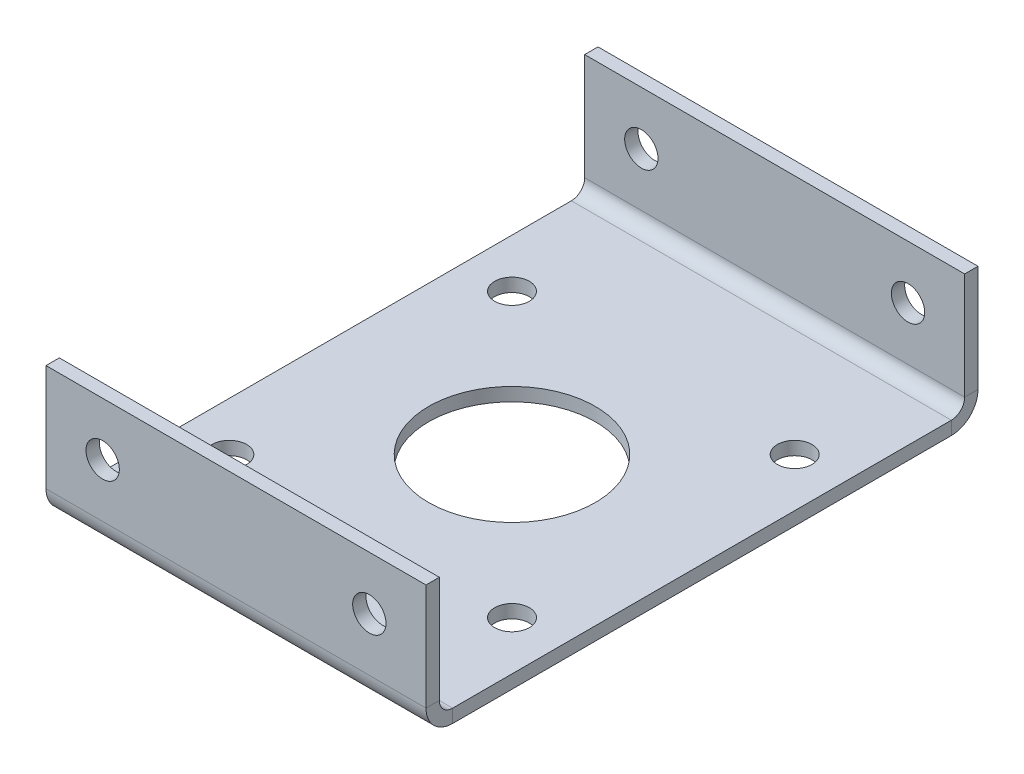
ISO-10303-21;
HEADER;
FILE_DESCRIPTION(('STEP AP214'),'2;1');
FILE_NAME('part.step','',(''),(''),'','','');
FILE_SCHEMA(('AUTOMOTIVE_DESIGN { 1 0 10303 214 1 1 1 1 }'));
ENDSEC;
DATA;
#1=APPLICATION_CONTEXT('core data for automotive mechanical design processes');
#2=APPLICATION_PROTOCOL_DEFINITION('international standard','automotive_design',2000,#1);
#3=PRODUCT_CONTEXT('',#1,'mechanical');
#4=PRODUCT('Part','Part','',(#3));
#5=PRODUCT_RELATED_PRODUCT_CATEGORY('part','',(#4));
#6=PRODUCT_DEFINITION_FORMATION('','',#4);
#7=PRODUCT_DEFINITION_CONTEXT('part definition',#1,'design');
#8=PRODUCT_DEFINITION('design','',#6,#7);
#9=PRODUCT_DEFINITION_SHAPE('','',#8);
#10=(LENGTH_UNIT() NAMED_UNIT(*) SI_UNIT(.MILLI.,.METRE.));
#11=(NAMED_UNIT(*) PLANE_ANGLE_UNIT() SI_UNIT($,.RADIAN.));
#12=(NAMED_UNIT(*) SI_UNIT($,.STERADIAN.) SOLID_ANGLE_UNIT());
#13=UNCERTAINTY_MEASURE_WITH_UNIT(LENGTH_MEASURE(1.E-05),#10,'distance_accuracy_value','');
#14=(GEOMETRIC_REPRESENTATION_CONTEXT(3) GLOBAL_UNCERTAINTY_ASSIGNED_CONTEXT((#13)) GLOBAL_UNIT_ASSIGNED_CONTEXT((#10,
#11,#12)) REPRESENTATION_CONTEXT('',''));
#15=CARTESIAN_POINT('',(0.,0.,0.));
#16=DIRECTION('',(0.,0.,1.));
#17=DIRECTION('',(1.,0.,0.));
#18=AXIS2_PLACEMENT_3D('',#15,#16,#17);
#19=CARTESIAN_POINT('',(0.,-1.27,0.));
#20=DIRECTION('',(0.,1.,0.));
#21=DIRECTION('',(0.,0.,1.));
#22=AXIS2_PLACEMENT_3D('',#19,#20,#21);
#23=PLANE('',#22);
#24=CARTESIAN_POINT('',(-13.462,-1.27000000000001,-13.4619999999999));
#25=DIRECTION('',(0.,1.,0.));
#26=DIRECTION('',(1.,0.,0.));
#27=AXIS2_PLACEMENT_3D('',#24,#25,#26);
#28=CIRCLE('',#27,1.651);
#29=CARTESIAN_POINT('',(-11.811,-1.27000000000001,-13.4619999999999));
#30=VERTEX_POINT('',#29);
#31=EDGE_CURVE('E273',#30,#30,#28,.T.);
#32=ORIENTED_EDGE('',*,*,#31,.T.);
#33=EDGE_LOOP('',(#32));
#34=FACE_BOUND('',#33,.T.);
#35=CARTESIAN_POINT('',(-13.462,-1.27000000000001,13.462));
#36=DIRECTION('',(0.,1.,0.));
#37=DIRECTION('',(0.,0.,-1.));
#38=AXIS2_PLACEMENT_3D('',#35,#36,#37);
#39=CIRCLE('',#38,1.651);
#40=CARTESIAN_POINT('',(-13.462,-1.27000000000001,11.811));
#41=VERTEX_POINT('',#40);
#42=EDGE_CURVE('E445',#41,#41,#39,.T.);
#43=ORIENTED_EDGE('',*,*,#42,.T.);
#44=EDGE_LOOP('',(#43));
#45=FACE_BOUND('',#44,.T.);
#46=CARTESIAN_POINT('',(13.4620000000001,-1.27000000000001,13.4619999999998));
#47=DIRECTION('',(0.,1.,0.));
#48=DIRECTION('',(-1.,0.,0.));
#49=AXIS2_PLACEMENT_3D('',#46,#47,#48);
#50=CIRCLE('',#49,1.651);
#51=CARTESIAN_POINT('',(11.8110000000001,-1.27000000000001,13.4619999999998));
#52=VERTEX_POINT('',#51);
#53=EDGE_CURVE('E453',#52,#52,#50,.T.);
#54=ORIENTED_EDGE('',*,*,#53,.T.);
#55=EDGE_LOOP('',(#54));
#56=FACE_BOUND('',#55,.T.);
#57=CARTESIAN_POINT('',(13.462,-1.27000000000001,-13.462));
#58=DIRECTION('',(0.,1.,0.));
#59=DIRECTION('',(0.,0.,1.));
#60=AXIS2_PLACEMENT_3D('',#57,#58,#59);
#61=CIRCLE('',#60,1.651);
#62=CARTESIAN_POINT('',(13.462,-1.27000000000001,-11.811));
#63=VERTEX_POINT('',#62);
#64=EDGE_CURVE('E288',#63,#63,#61,.T.);
#65=ORIENTED_EDGE('',*,*,#64,.T.);
#66=EDGE_LOOP('',(#65));
#67=FACE_BOUND('',#66,.T.);
#68=CARTESIAN_POINT('',(0.,-1.27,0.));
#69=DIRECTION('',(0.,1.,0.));
#70=DIRECTION('',(0.,0.,1.));
#71=AXIS2_PLACEMENT_3D('',#68,#69,#70);
#72=CIRCLE('',#71,7.9375);
#73=CARTESIAN_POINT('',(0.,-1.27,7.9375));
#74=VERTEX_POINT('',#73);
#75=EDGE_CURVE('E248',#74,#74,#72,.T.);
#76=ORIENTED_EDGE('',*,*,#75,.T.);
#77=EDGE_LOOP('',(#76));
#78=FACE_BOUND('',#77,.T.);
#79=DIRECTION('',(-1.,0.,0.));
#80=VECTOR('',#79,1.);
#81=CARTESIAN_POINT('',(-18.0975,-1.27000000000001,-23.749));
#82=LINE('',#81,#80);
#83=CARTESIAN_POINT('',(-18.0975,-1.27000000000001,-23.749));
#84=VERTEX_POINT('',#83);
#85=CARTESIAN_POINT('',(18.0975,-1.27,-23.749));
#86=VERTEX_POINT('',#85);
#87=EDGE_CURVE('E137',#84,#86,#82,.F.);
#88=ORIENTED_EDGE('',*,*,#87,.T.);
#89=DIRECTION('',(0.,0.,-1.));
#90=VECTOR('',#89,1.);
#91=CARTESIAN_POINT('',(18.0975,-1.27,-25.019));
#92=LINE('',#91,#90);
#93=CARTESIAN_POINT('',(18.0975,-1.27,23.749));
#94=VERTEX_POINT('',#93);
#95=EDGE_CURVE('E48',#94,#86,#92,.T.);
#96=ORIENTED_EDGE('',*,*,#95,.F.);
#97=DIRECTION('',(1.,0.,0.));
#98=VECTOR('',#97,1.);
#99=CARTESIAN_POINT('',(18.0975,-1.27,23.749));
#100=LINE('',#99,#98);
#101=CARTESIAN_POINT('',(-18.0975,-1.27,23.749));
#102=VERTEX_POINT('',#101);
#103=EDGE_CURVE('E227',#94,#102,#100,.F.);
#104=ORIENTED_EDGE('',*,*,#103,.T.);
#105=DIRECTION('',(0.,0.,1.));
#106=VECTOR('',#105,1.);
#107=CARTESIAN_POINT('',(-18.0975,-1.27,-25.019));
#108=LINE('',#107,#106);
#109=EDGE_CURVE('E11',#84,#102,#108,.T.);
#110=ORIENTED_EDGE('',*,*,#109,.F.);
#111=EDGE_LOOP('',(#88,#96,#104,#110));
#112=FACE_BOUND('',#111,.T.);
#113=ADVANCED_FACE('F39',(#34,#45,#56,#67,#78,#112),#23,.F.);
#114=CARTESIAN_POINT('',(0.,0.,0.));
#115=DIRECTION('',(0.,1.,0.));
#116=DIRECTION('',(0.,0.,1.));
#117=AXIS2_PLACEMENT_3D('',#114,#115,#116);
#118=PLANE('',#117);
#119=CARTESIAN_POINT('',(-13.462,0.,-13.4619999999999));
#120=DIRECTION('',(0.,1.,0.));
#121=DIRECTION('',(1.,0.,0.));
#122=AXIS2_PLACEMENT_3D('',#119,#120,#121);
#123=CIRCLE('',#122,1.651);
#124=CARTESIAN_POINT('',(-11.811,0.,-13.4619999999999));
#125=VERTEX_POINT('',#124);
#126=EDGE_CURVE('E444',#125,#125,#123,.T.);
#127=ORIENTED_EDGE('',*,*,#126,.F.);
#128=EDGE_LOOP('',(#127));
#129=FACE_BOUND('',#128,.T.);
#130=CARTESIAN_POINT('',(-13.462,0.,13.462));
#131=DIRECTION('',(0.,1.,0.));
#132=DIRECTION('',(0.,0.,-1.));
#133=AXIS2_PLACEMENT_3D('',#130,#131,#132);
#134=CIRCLE('',#133,1.651);
#135=CARTESIAN_POINT('',(-13.462,0.,11.811));
#136=VERTEX_POINT('',#135);
#137=EDGE_CURVE('E449',#136,#136,#134,.T.);
#138=ORIENTED_EDGE('',*,*,#137,.F.);
#139=EDGE_LOOP('',(#138));
#140=FACE_BOUND('',#139,.T.);
#141=CARTESIAN_POINT('',(13.4620000000001,0.,13.4619999999998));
#142=DIRECTION('',(0.,1.,0.));
#143=DIRECTION('',(-1.,0.,0.));
#144=AXIS2_PLACEMENT_3D('',#141,#142,#143);
#145=CIRCLE('',#144,1.651);
#146=CARTESIAN_POINT('',(11.8110000000001,0.,13.4619999999998));
#147=VERTEX_POINT('',#146);
#148=EDGE_CURVE('E276',#147,#147,#145,.T.);
#149=ORIENTED_EDGE('',*,*,#148,.F.);
#150=EDGE_LOOP('',(#149));
#151=FACE_BOUND('',#150,.T.);
#152=CARTESIAN_POINT('',(13.462,0.,-13.462));
#153=DIRECTION('',(0.,1.,0.));
#154=DIRECTION('',(0.,0.,1.));
#155=AXIS2_PLACEMENT_3D('',#152,#153,#154);
#156=CIRCLE('',#155,1.651);
#157=CARTESIAN_POINT('',(13.462,0.,-11.811));
#158=VERTEX_POINT('',#157);
#159=EDGE_CURVE('E287',#158,#158,#156,.T.);
#160=ORIENTED_EDGE('',*,*,#159,.F.);
#161=EDGE_LOOP('',(#160));
#162=FACE_BOUND('',#161,.T.);
#163=CARTESIAN_POINT('',(0.,0.,0.));
#164=DIRECTION('',(0.,1.,0.));
#165=DIRECTION('',(0.,0.,1.));
#166=AXIS2_PLACEMENT_3D('',#163,#164,#165);
#167=CIRCLE('',#166,7.9375);
#168=CARTESIAN_POINT('',(0.,0.,7.9375));
#169=VERTEX_POINT('',#168);
#170=EDGE_CURVE('E245',#169,#169,#167,.T.);
#171=ORIENTED_EDGE('',*,*,#170,.F.);
#172=EDGE_LOOP('',(#171));
#173=FACE_BOUND('',#172,.T.);
#174=DIRECTION('',(0.,0.,-1.));
#175=VECTOR('',#174,1.);
#176=CARTESIAN_POINT('',(18.0975,0.,-25.019));
#177=LINE('',#176,#175);
#178=CARTESIAN_POINT('',(18.0975,0.,23.749));
#179=VERTEX_POINT('',#178);
#180=CARTESIAN_POINT('',(18.0975,0.,-23.749));
#181=VERTEX_POINT('',#180);
#182=EDGE_CURVE('E251',#179,#181,#177,.T.);
#183=ORIENTED_EDGE('',*,*,#182,.T.);
#184=DIRECTION('',(-1.,0.,0.));
#185=VECTOR('',#184,1.);
#186=CARTESIAN_POINT('',(-18.0975,0.,-23.749));
#187=LINE('',#186,#185);
#188=CARTESIAN_POINT('',(-18.0975,0.,-23.749));
#189=VERTEX_POINT('',#188);
#190=EDGE_CURVE('E188',#189,#181,#187,.F.);
#191=ORIENTED_EDGE('',*,*,#190,.F.);
#192=DIRECTION('',(0.,0.,1.));
#193=VECTOR('',#192,1.);
#194=CARTESIAN_POINT('',(-18.0975,0.,-25.019));
#195=LINE('',#194,#193);
#196=CARTESIAN_POINT('',(-18.0975,0.,23.749));
#197=VERTEX_POINT('',#196);
#198=EDGE_CURVE('E255',#189,#197,#195,.T.);
#199=ORIENTED_EDGE('',*,*,#198,.T.);
#200=DIRECTION('',(1.,0.,0.));
#201=VECTOR('',#200,1.);
#202=CARTESIAN_POINT('',(18.0975,0.,23.749));
#203=LINE('',#202,#201);
#204=EDGE_CURVE('E56',#179,#197,#203,.F.);
#205=ORIENTED_EDGE('',*,*,#204,.F.);
#206=EDGE_LOOP('',(#183,#191,#199,#205));
#207=FACE_BOUND('',#206,.T.);
#208=ADVANCED_FACE('F325',(#129,#140,#151,#162,#173,#207),#118,.T.);
#209=CARTESIAN_POINT('',(-18.0975,-1.27,-25.019));
#210=DIRECTION('',(-1.,0.,0.));
#211=DIRECTION('',(0.,0.,1.));
#212=AXIS2_PLACEMENT_3D('',#209,#210,#211);
#213=PLANE('',#212);
#214=ORIENTED_EDGE('',*,*,#198,.F.);
#215=DIRECTION('',(0.,-1.,0.));
#216=VECTOR('',#215,1.);
#217=CARTESIAN_POINT('',(-18.0975,0.,-23.749));
#218=LINE('',#217,#216);
#219=EDGE_CURVE('E184',#189,#84,#218,.T.);
#220=ORIENTED_EDGE('',*,*,#219,.T.);
#221=ORIENTED_EDGE('',*,*,#109,.T.);
#222=DIRECTION('',(0.,-1.,0.));
#223=VECTOR('',#222,1.);
#224=CARTESIAN_POINT('',(-18.0975,0.,23.749));
#225=LINE('',#224,#223);
#226=EDGE_CURVE('E242',#197,#102,#225,.T.);
#227=ORIENTED_EDGE('',*,*,#226,.F.);
#228=EDGE_LOOP('',(#214,#220,#221,#227));
#229=FACE_BOUND('',#228,.T.);
#230=ADVANCED_FACE('F331',(#229),#213,.T.);
#231=CARTESIAN_POINT('',(18.0975,-1.27,-25.019));
#232=DIRECTION('',(1.,0.,0.));
#233=DIRECTION('',(0.,0.,-1.));
#234=AXIS2_PLACEMENT_3D('',#231,#232,#233);
#235=PLANE('',#234);
#236=DIRECTION('',(0.,-1.,0.));
#237=VECTOR('',#236,1.);
#238=CARTESIAN_POINT('',(18.0975,0.,-23.749));
#239=LINE('',#238,#237);
#240=EDGE_CURVE('E192',#181,#86,#239,.T.);
#241=ORIENTED_EDGE('',*,*,#240,.F.);
#242=ORIENTED_EDGE('',*,*,#182,.F.);
#243=DIRECTION('',(0.,-1.,0.));
#244=VECTOR('',#243,1.);
#245=CARTESIAN_POINT('',(18.0975,0.,23.749));
#246=LINE('',#245,#244);
#247=EDGE_CURVE('E233',#179,#94,#246,.T.);
#248=ORIENTED_EDGE('',*,*,#247,.T.);
#249=ORIENTED_EDGE('',*,*,#95,.T.);
#250=EDGE_LOOP('',(#241,#242,#248,#249));
#251=FACE_BOUND('',#250,.T.);
#252=ADVANCED_FACE('F41',(#251),#235,.T.);
#253=CARTESIAN_POINT('',(0.,-1.27,0.));
#254=DIRECTION('',(0.,1.,0.));
#255=DIRECTION('',(0.,0.,1.));
#256=AXIS2_PLACEMENT_3D('',#253,#254,#255);
#257=CYLINDRICAL_SURFACE('',#256,7.9375);
#258=ORIENTED_EDGE('',*,*,#75,.F.);
#259=EDGE_LOOP('',(#258));
#260=FACE_BOUND('',#259,.T.);
#261=ORIENTED_EDGE('',*,*,#170,.T.);
#262=EDGE_LOOP('',(#261));
#263=FACE_BOUND('',#262,.T.);
#264=ADVANCED_FACE('F337',(#260,#263),#257,.F.);
#265=CARTESIAN_POINT('',(-18.0975,1.27,23.749));
#266=DIRECTION('',(-1.,0.,0.));
#267=DIRECTION('',(0.,0.,1.));
#268=AXIS2_PLACEMENT_3D('',#265,#266,#267);
#269=PLANE('',#268);
#270=DIRECTION('',(0.,0.,1.));
#271=VECTOR('',#270,1.);
#272=CARTESIAN_POINT('',(-18.0975,1.27,25.019));
#273=LINE('',#272,#271);
#274=CARTESIAN_POINT('',(-18.0975,1.27,25.019));
#275=VERTEX_POINT('',#274);
#276=CARTESIAN_POINT('',(-18.0975,1.27,26.289));
#277=VERTEX_POINT('',#276);
#278=EDGE_CURVE('E195',#275,#277,#273,.T.);
#279=ORIENTED_EDGE('',*,*,#278,.F.);
#280=CARTESIAN_POINT('',(-18.0975,1.27,23.749));
#281=DIRECTION('',(1.,0.,0.));
#282=DIRECTION('',(0.,0.,-1.));
#283=AXIS2_PLACEMENT_3D('',#280,#281,#282);
#284=CIRCLE('',#283,1.27);
#285=EDGE_CURVE('E236',#197,#275,#284,.F.);
#286=ORIENTED_EDGE('',*,*,#285,.F.);
#287=ORIENTED_EDGE('',*,*,#226,.T.);
#288=CARTESIAN_POINT('',(-18.0975,1.27,23.749));
#289=DIRECTION('',(1.,0.,0.));
#290=DIRECTION('',(0.,0.,-1.));
#291=AXIS2_PLACEMENT_3D('',#288,#289,#290);
#292=CIRCLE('',#291,2.54);
#293=EDGE_CURVE('E229',#102,#277,#292,.F.);
#294=ORIENTED_EDGE('',*,*,#293,.T.);
#295=EDGE_LOOP('',(#279,#286,#287,#294));
#296=FACE_BOUND('',#295,.T.);
#297=ADVANCED_FACE('F378',(#296),#269,.T.);
#298=CARTESIAN_POINT('',(18.0975,1.27,23.749));
#299=DIRECTION('',(-1.,0.,0.));
#300=DIRECTION('',(0.,0.,1.));
#301=AXIS2_PLACEMENT_3D('',#298,#299,#300);
#302=PLANE('',#301);
#303=CARTESIAN_POINT('',(18.0975,1.27,23.749));
#304=DIRECTION('',(1.,0.,0.));
#305=DIRECTION('',(0.,0.,-1.));
#306=AXIS2_PLACEMENT_3D('',#303,#304,#305);
#307=CIRCLE('',#306,1.27);
#308=CARTESIAN_POINT('',(18.0975,1.27,25.019));
#309=VERTEX_POINT('',#308);
#310=EDGE_CURVE('E226',#309,#179,#307,.T.);
#311=ORIENTED_EDGE('',*,*,#310,.F.);
#312=DIRECTION('',(0.,0.,1.));
#313=VECTOR('',#312,1.);
#314=CARTESIAN_POINT('',(18.0975,1.27,25.019));
#315=LINE('',#314,#313);
#316=CARTESIAN_POINT('',(18.0975,1.27,26.289));
#317=VERTEX_POINT('',#316);
#318=EDGE_CURVE('E199',#309,#317,#315,.T.);
#319=ORIENTED_EDGE('',*,*,#318,.T.);
#320=CARTESIAN_POINT('',(18.0975,1.27,23.749));
#321=DIRECTION('',(1.,0.,0.));
#322=DIRECTION('',(0.,0.,-1.));
#323=AXIS2_PLACEMENT_3D('',#320,#321,#322);
#324=CIRCLE('',#323,2.54);
#325=EDGE_CURVE('E230',#317,#94,#324,.T.);
#326=ORIENTED_EDGE('',*,*,#325,.T.);
#327=ORIENTED_EDGE('',*,*,#247,.F.);
#328=EDGE_LOOP('',(#311,#319,#326,#327));
#329=FACE_BOUND('',#328,.T.);
#330=ADVANCED_FACE('F349',(#329),#302,.F.);
#331=CARTESIAN_POINT('',(18.0975,1.27,23.749));
#332=DIRECTION('',(1.,0.,0.));
#333=DIRECTION('',(0.,0.,1.));
#334=AXIS2_PLACEMENT_3D('',#331,#332,#333);
#335=CYLINDRICAL_SURFACE('',#334,2.54);
#336=ORIENTED_EDGE('',*,*,#103,.F.);
#337=ORIENTED_EDGE('',*,*,#325,.F.);
#338=DIRECTION('',(-1.,0.,0.));
#339=VECTOR('',#338,1.);
#340=CARTESIAN_POINT('',(0.,1.27,26.289));
#341=LINE('',#340,#339);
#342=EDGE_CURVE('E202',#317,#277,#341,.T.);
#343=ORIENTED_EDGE('',*,*,#342,.T.);
#344=ORIENTED_EDGE('',*,*,#293,.F.);
#345=EDGE_LOOP('',(#336,#337,#343,#344));
#346=FACE_BOUND('',#345,.T.);
#347=ADVANCED_FACE('F376',(#346),#335,.T.);
#348=CARTESIAN_POINT('',(18.0975,1.27,23.749));
#349=DIRECTION('',(1.,0.,0.));
#350=DIRECTION('',(0.,0.,1.));
#351=AXIS2_PLACEMENT_3D('',#348,#349,#350);
#352=CYLINDRICAL_SURFACE('',#351,1.27);
#353=ORIENTED_EDGE('',*,*,#204,.T.);
#354=ORIENTED_EDGE('',*,*,#285,.T.);
#355=DIRECTION('',(1.,0.,0.));
#356=VECTOR('',#355,1.);
#357=CARTESIAN_POINT('',(-18.0975,1.27,25.019));
#358=LINE('',#357,#356);
#359=EDGE_CURVE('E197',#275,#309,#358,.T.);
#360=ORIENTED_EDGE('',*,*,#359,.T.);
#361=ORIENTED_EDGE('',*,*,#310,.T.);
#362=EDGE_LOOP('',(#353,#354,#360,#361));
#363=FACE_BOUND('',#362,.T.);
#364=ADVANCED_FACE('F352',(#363),#352,.F.);
#365=CARTESIAN_POINT('',(-18.0975,0.,26.289));
#366=DIRECTION('',(1.,0.,0.));
#367=DIRECTION('',(0.,1.,0.));
#368=AXIS2_PLACEMENT_3D('',#365,#366,#367);
#369=PLANE('',#368);
#370=ORIENTED_EDGE('',*,*,#278,.T.);
#371=DIRECTION('',(0.,-1.,0.));
#372=VECTOR('',#371,1.);
#373=CARTESIAN_POINT('',(-18.0975,0.,26.289));
#374=LINE('',#373,#372);
#375=CARTESIAN_POINT('',(-18.0975,11.43,26.289));
#376=VERTEX_POINT('',#375);
#377=EDGE_CURVE('E207',#376,#277,#374,.T.);
#378=ORIENTED_EDGE('',*,*,#377,.F.);
#379=DIRECTION('',(0.,0.,-1.));
#380=VECTOR('',#379,1.);
#381=CARTESIAN_POINT('',(-18.0975,11.43,26.289));
#382=LINE('',#381,#380);
#383=CARTESIAN_POINT('',(-18.0975,11.43,25.019));
#384=VERTEX_POINT('',#383);
#385=EDGE_CURVE('E215',#376,#384,#382,.T.);
#386=ORIENTED_EDGE('',*,*,#385,.T.);
#387=DIRECTION('',(0.,-1.,0.));
#388=VECTOR('',#387,1.);
#389=CARTESIAN_POINT('',(-18.0975,0.,25.019));
#390=LINE('',#389,#388);
#391=EDGE_CURVE('E206',#384,#275,#390,.T.);
#392=ORIENTED_EDGE('',*,*,#391,.T.);
#393=EDGE_LOOP('',(#370,#378,#386,#392));
#394=FACE_BOUND('',#393,.T.);
#395=ADVANCED_FACE('F361',(#394),#369,.F.);
#396=CARTESIAN_POINT('',(18.0975,11.43,26.289));
#397=DIRECTION('',(-1.,0.,0.));
#398=DIRECTION('',(0.,-1.,0.));
#399=AXIS2_PLACEMENT_3D('',#396,#397,#398);
#400=PLANE('',#399);
#401=ORIENTED_EDGE('',*,*,#318,.F.);
#402=DIRECTION('',(0.,1.,0.));
#403=VECTOR('',#402,1.);
#404=CARTESIAN_POINT('',(18.0975,11.43,25.019));
#405=LINE('',#404,#403);
#406=CARTESIAN_POINT('',(18.0975,11.43,25.019));
#407=VERTEX_POINT('',#406);
#408=EDGE_CURVE('E218',#309,#407,#405,.T.);
#409=ORIENTED_EDGE('',*,*,#408,.T.);
#410=DIRECTION('',(0.,0.,-1.));
#411=VECTOR('',#410,1.);
#412=CARTESIAN_POINT('',(18.0975,11.43,26.289));
#413=LINE('',#412,#411);
#414=CARTESIAN_POINT('',(18.0975,11.43,26.289));
#415=VERTEX_POINT('',#414);
#416=EDGE_CURVE('E223',#415,#407,#413,.T.);
#417=ORIENTED_EDGE('',*,*,#416,.F.);
#418=DIRECTION('',(0.,1.,0.));
#419=VECTOR('',#418,1.);
#420=CARTESIAN_POINT('',(18.0975,11.43,26.289));
#421=LINE('',#420,#419);
#422=EDGE_CURVE('E210',#317,#415,#421,.T.);
#423=ORIENTED_EDGE('',*,*,#422,.F.);
#424=EDGE_LOOP('',(#401,#409,#417,#423));
#425=FACE_BOUND('',#424,.T.);
#426=ADVANCED_FACE('F370',(#425),#400,.F.);
#427=CARTESIAN_POINT('',(0.,0.,26.289));
#428=DIRECTION('',(0.,0.,-1.));
#429=DIRECTION('',(-1.,0.,0.));
#430=AXIS2_PLACEMENT_3D('',#427,#428,#429);
#431=PLANE('',#430);
#432=CARTESIAN_POINT('',(12.7,6.35000000000001,26.289));
#433=DIRECTION('',(0.,0.,-1.));
#434=DIRECTION('',(-1.,0.,0.));
#435=AXIS2_PLACEMENT_3D('',#432,#433,#434);
#436=CIRCLE('',#435,1.5875);
#437=CARTESIAN_POINT('',(11.1125,6.35000000000001,26.289));
#438=VERTEX_POINT('',#437);
#439=EDGE_CURVE('E261',#438,#438,#436,.T.);
#440=ORIENTED_EDGE('',*,*,#439,.T.);
#441=EDGE_LOOP('',(#440));
#442=FACE_BOUND('',#441,.T.);
#443=CARTESIAN_POINT('',(-12.7,6.35000000000001,26.289));
#444=DIRECTION('',(0.,0.,-1.));
#445=DIRECTION('',(1.,0.,0.));
#446=AXIS2_PLACEMENT_3D('',#443,#444,#445);
#447=CIRCLE('',#446,1.5875);
#448=CARTESIAN_POINT('',(-11.1125,6.35000000000001,26.289));
#449=VERTEX_POINT('',#448);
#450=EDGE_CURVE('E268',#449,#449,#447,.T.);
#451=ORIENTED_EDGE('',*,*,#450,.T.);
#452=EDGE_LOOP('',(#451));
#453=FACE_BOUND('',#452,.T.);
#454=ORIENTED_EDGE('',*,*,#342,.F.);
#455=ORIENTED_EDGE('',*,*,#422,.T.);
#456=DIRECTION('',(-1.,0.,0.));
#457=VECTOR('',#456,1.);
#458=CARTESIAN_POINT('',(-18.0975,11.43,26.289));
#459=LINE('',#458,#457);
#460=EDGE_CURVE('E213',#415,#376,#459,.T.);
#461=ORIENTED_EDGE('',*,*,#460,.T.);
#462=ORIENTED_EDGE('',*,*,#377,.T.);
#463=EDGE_LOOP('',(#454,#455,#461,#462));
#464=FACE_BOUND('',#463,.T.);
#465=ADVANCED_FACE('F373',(#442,#453,#464),#431,.F.);
#466=CARTESIAN_POINT('',(0.,0.,25.019));
#467=DIRECTION('',(0.,0.,-1.));
#468=DIRECTION('',(-1.,0.,0.));
#469=AXIS2_PLACEMENT_3D('',#466,#467,#468);
#470=PLANE('',#469);
#471=CARTESIAN_POINT('',(12.7,6.35000000000001,25.019));
#472=DIRECTION('',(0.,0.,-1.));
#473=DIRECTION('',(-1.,0.,0.));
#474=AXIS2_PLACEMENT_3D('',#471,#472,#473);
#475=CIRCLE('',#474,1.5875);
#476=CARTESIAN_POINT('',(11.1125,6.35000000000001,25.019));
#477=VERTEX_POINT('',#476);
#478=EDGE_CURVE('E284',#477,#477,#475,.T.);
#479=ORIENTED_EDGE('',*,*,#478,.F.);
#480=EDGE_LOOP('',(#479));
#481=FACE_BOUND('',#480,.T.);
#482=CARTESIAN_POINT('',(-12.7,6.35000000000001,25.019));
#483=DIRECTION('',(0.,0.,-1.));
#484=DIRECTION('',(-1.,0.,0.));
#485=AXIS2_PLACEMENT_3D('',#482,#483,#484);
#486=CIRCLE('',#485,1.5875);
#487=CARTESIAN_POINT('',(-14.2875,6.35000000000001,25.019));
#488=VERTEX_POINT('',#487);
#489=EDGE_CURVE('E265',#488,#488,#486,.T.);
#490=ORIENTED_EDGE('',*,*,#489,.F.);
#491=EDGE_LOOP('',(#490));
#492=FACE_BOUND('',#491,.T.);
#493=ORIENTED_EDGE('',*,*,#408,.F.);
#494=ORIENTED_EDGE('',*,*,#359,.F.);
#495=ORIENTED_EDGE('',*,*,#391,.F.);
#496=DIRECTION('',(-1.,0.,0.));
#497=VECTOR('',#496,1.);
#498=CARTESIAN_POINT('',(-18.0975,11.43,25.019));
#499=LINE('',#498,#497);
#500=EDGE_CURVE('E211',#407,#384,#499,.T.);
#501=ORIENTED_EDGE('',*,*,#500,.F.);
#502=EDGE_LOOP('',(#493,#494,#495,#501));
#503=FACE_BOUND('',#502,.T.);
#504=ADVANCED_FACE('F358',(#481,#492,#503),#470,.T.);
#505=CARTESIAN_POINT('',(-18.0975,11.43,26.289));
#506=DIRECTION('',(0.,-1.,0.));
#507=DIRECTION('',(0.,0.,-1.));
#508=AXIS2_PLACEMENT_3D('',#505,#506,#507);
#509=PLANE('',#508);
#510=ORIENTED_EDGE('',*,*,#500,.T.);
#511=ORIENTED_EDGE('',*,*,#385,.F.);
#512=ORIENTED_EDGE('',*,*,#460,.F.);
#513=ORIENTED_EDGE('',*,*,#416,.T.);
#514=EDGE_LOOP('',(#510,#511,#512,#513));
#515=FACE_BOUND('',#514,.T.);
#516=ADVANCED_FACE('F366',(#515),#509,.F.);
#517=CARTESIAN_POINT('',(18.0975,1.26999999999999,-23.749));
#518=DIRECTION('',(1.,0.,0.));
#519=DIRECTION('',(0.,0.,-1.));
#520=AXIS2_PLACEMENT_3D('',#517,#518,#519);
#521=PLANE('',#520);
#522=DIRECTION('',(0.,0.,-1.));
#523=VECTOR('',#522,1.);
#524=CARTESIAN_POINT('',(18.0975,1.27,-25.019));
#525=LINE('',#524,#523);
#526=CARTESIAN_POINT('',(18.0975,1.26999999999999,-25.019));
#527=VERTEX_POINT('',#526);
#528=CARTESIAN_POINT('',(18.0975,1.26999999999999,-26.289));
#529=VERTEX_POINT('',#528);
#530=EDGE_CURVE('E291',#527,#529,#525,.T.);
#531=ORIENTED_EDGE('',*,*,#530,.F.);
#532=CARTESIAN_POINT('',(18.0975,1.26999999999999,-23.749));
#533=DIRECTION('',(-1.,0.,0.));
#534=DIRECTION('',(0.,0.,1.));
#535=AXIS2_PLACEMENT_3D('',#532,#533,#534);
#536=CIRCLE('',#535,1.27);
#537=EDGE_CURVE('E140',#181,#527,#536,.F.);
#538=ORIENTED_EDGE('',*,*,#537,.F.);
#539=ORIENTED_EDGE('',*,*,#240,.T.);
#540=CARTESIAN_POINT('',(18.0975,1.26999999999999,-23.749));
#541=DIRECTION('',(-1.,0.,0.));
#542=DIRECTION('',(0.,0.,1.));
#543=AXIS2_PLACEMENT_3D('',#540,#541,#542);
#544=CIRCLE('',#543,2.54);
#545=EDGE_CURVE('E183',#86,#529,#544,.F.);
#546=ORIENTED_EDGE('',*,*,#545,.T.);
#547=EDGE_LOOP('',(#531,#538,#539,#546));
#548=FACE_BOUND('',#547,.T.);
#549=ADVANCED_FACE('F301',(#548),#521,.T.);
#550=CARTESIAN_POINT('',(-18.0975,1.26999999999999,-23.749));
#551=DIRECTION('',(1.,0.,0.));
#552=DIRECTION('',(0.,0.,-1.));
#553=AXIS2_PLACEMENT_3D('',#550,#551,#552);
#554=PLANE('',#553);
#555=CARTESIAN_POINT('',(-18.0975,1.26999999999999,-23.749));
#556=DIRECTION('',(-1.,0.,0.));
#557=DIRECTION('',(0.,0.,1.));
#558=AXIS2_PLACEMENT_3D('',#555,#556,#557);
#559=CIRCLE('',#558,1.27);
#560=CARTESIAN_POINT('',(-18.0975,1.26999999999999,-25.019));
#561=VERTEX_POINT('',#560);
#562=EDGE_CURVE('E147',#561,#189,#559,.T.);
#563=ORIENTED_EDGE('',*,*,#562,.F.);
#564=DIRECTION('',(0.,0.,-1.));
#565=VECTOR('',#564,1.);
#566=CARTESIAN_POINT('',(-18.0975,1.27,-25.019));
#567=LINE('',#566,#565);
#568=CARTESIAN_POINT('',(-18.0975,1.27000000000001,-26.289));
#569=VERTEX_POINT('',#568);
#570=EDGE_CURVE('E144',#561,#569,#567,.T.);
#571=ORIENTED_EDGE('',*,*,#570,.T.);
#572=CARTESIAN_POINT('',(-18.0975,1.26999999999999,-23.749));
#573=DIRECTION('',(-1.,0.,0.));
#574=DIRECTION('',(0.,0.,1.));
#575=AXIS2_PLACEMENT_3D('',#572,#573,#574);
#576=CIRCLE('',#575,2.54);
#577=EDGE_CURVE('E130',#569,#84,#576,.T.);
#578=ORIENTED_EDGE('',*,*,#577,.T.);
#579=ORIENTED_EDGE('',*,*,#219,.F.);
#580=EDGE_LOOP('',(#563,#571,#578,#579));
#581=FACE_BOUND('',#580,.T.);
#582=ADVANCED_FACE('F145',(#581),#554,.F.);
#583=CARTESIAN_POINT('',(-18.0975,1.26999999999999,-23.749));
#584=DIRECTION('',(-1.,0.,0.));
#585=DIRECTION('',(0.,0.,-1.));
#586=AXIS2_PLACEMENT_3D('',#583,#584,#585);
#587=CYLINDRICAL_SURFACE('',#586,2.54);
#588=ORIENTED_EDGE('',*,*,#87,.F.);
#589=ORIENTED_EDGE('',*,*,#577,.F.);
#590=DIRECTION('',(1.,0.,0.));
#591=VECTOR('',#590,1.);
#592=CARTESIAN_POINT('',(0.,1.27000000000001,-26.289));
#593=LINE('',#592,#591);
#594=EDGE_CURVE('E135',#569,#529,#593,.T.);
#595=ORIENTED_EDGE('',*,*,#594,.T.);
#596=ORIENTED_EDGE('',*,*,#545,.F.);
#597=EDGE_LOOP('',(#588,#589,#595,#596));
#598=FACE_BOUND('',#597,.T.);
#599=ADVANCED_FACE('F132',(#598),#587,.T.);
#600=CARTESIAN_POINT('',(-18.0975,1.26999999999999,-23.749));
#601=DIRECTION('',(-1.,0.,0.));
#602=DIRECTION('',(0.,0.,-1.));
#603=AXIS2_PLACEMENT_3D('',#600,#601,#602);
#604=CYLINDRICAL_SURFACE('',#603,1.27);
#605=ORIENTED_EDGE('',*,*,#190,.T.);
#606=ORIENTED_EDGE('',*,*,#537,.T.);
#607=DIRECTION('',(-1.,0.,0.));
#608=VECTOR('',#607,1.);
#609=CARTESIAN_POINT('',(18.0975,1.27,-25.019));
#610=LINE('',#609,#608);
#611=EDGE_CURVE('E152',#527,#561,#610,.T.);
#612=ORIENTED_EDGE('',*,*,#611,.T.);
#613=ORIENTED_EDGE('',*,*,#562,.T.);
#614=EDGE_LOOP('',(#605,#606,#612,#613));
#615=FACE_BOUND('',#614,.T.);
#616=ADVANCED_FACE('F304',(#615),#604,.F.);
#617=CARTESIAN_POINT('',(-18.0975,0.,-26.289));
#618=DIRECTION('',(-1.,0.,0.));
#619=DIRECTION('',(0.,-1.,0.));
#620=AXIS2_PLACEMENT_3D('',#617,#618,#619);
#621=PLANE('',#620);
#622=DIRECTION('',(0.,-1.,0.));
#623=VECTOR('',#622,1.);
#624=CARTESIAN_POINT('',(-18.0975,0.,-26.289));
#625=LINE('',#624,#623);
#626=CARTESIAN_POINT('',(-18.0975,11.43,-26.289));
#627=VERTEX_POINT('',#626);
#628=EDGE_CURVE('E159',#627,#569,#625,.T.);
#629=ORIENTED_EDGE('',*,*,#628,.T.);
#630=ORIENTED_EDGE('',*,*,#570,.F.);
#631=DIRECTION('',(0.,-1.,0.));
#632=VECTOR('',#631,1.);
#633=CARTESIAN_POINT('',(-18.0975,0.,-25.019));
#634=LINE('',#633,#632);
#635=CARTESIAN_POINT('',(-18.0975,11.43,-25.019));
#636=VERTEX_POINT('',#635);
#637=EDGE_CURVE('E162',#636,#561,#634,.T.);
#638=ORIENTED_EDGE('',*,*,#637,.F.);
#639=DIRECTION('',(0.,0.,1.));
#640=VECTOR('',#639,1.);
#641=CARTESIAN_POINT('',(-18.0975,11.43,-26.289));
#642=LINE('',#641,#640);
#643=EDGE_CURVE('E165',#627,#636,#642,.T.);
#644=ORIENTED_EDGE('',*,*,#643,.F.);
#645=EDGE_LOOP('',(#629,#630,#638,#644));
#646=FACE_BOUND('',#645,.T.);
#647=ADVANCED_FACE('F164',(#646),#621,.T.);
#648=CARTESIAN_POINT('',(18.0975,11.43,-26.289));
#649=DIRECTION('',(1.,0.,0.));
#650=DIRECTION('',(0.,1.,0.));
#651=AXIS2_PLACEMENT_3D('',#648,#649,#650);
#652=PLANE('',#651);
#653=DIRECTION('',(0.,1.,0.));
#654=VECTOR('',#653,1.);
#655=CARTESIAN_POINT('',(18.0975,11.43,-25.019));
#656=LINE('',#655,#654);
#657=CARTESIAN_POINT('',(18.0975,11.43,-25.019));
#658=VERTEX_POINT('',#657);
#659=EDGE_CURVE('E167',#527,#658,#656,.T.);
#660=ORIENTED_EDGE('',*,*,#659,.F.);
#661=ORIENTED_EDGE('',*,*,#530,.T.);
#662=DIRECTION('',(0.,1.,0.));
#663=VECTOR('',#662,1.);
#664=CARTESIAN_POINT('',(18.0975,11.43,-26.289));
#665=LINE('',#664,#663);
#666=CARTESIAN_POINT('',(18.0975,11.43,-26.289));
#667=VERTEX_POINT('',#666);
#668=EDGE_CURVE('E161',#529,#667,#665,.T.);
#669=ORIENTED_EDGE('',*,*,#668,.T.);
#670=DIRECTION('',(0.,0.,1.));
#671=VECTOR('',#670,1.);
#672=CARTESIAN_POINT('',(18.0975,11.43,-26.289));
#673=LINE('',#672,#671);
#674=EDGE_CURVE('E175',#667,#658,#673,.T.);
#675=ORIENTED_EDGE('',*,*,#674,.T.);
#676=EDGE_LOOP('',(#660,#661,#669,#675));
#677=FACE_BOUND('',#676,.T.);
#678=ADVANCED_FACE('F297',(#677),#652,.T.);
#679=CARTESIAN_POINT('',(0.,0.,-26.289));
#680=DIRECTION('',(0.,0.,1.));
#681=DIRECTION('',(-1.,0.,0.));
#682=AXIS2_PLACEMENT_3D('',#679,#680,#681);
#683=PLANE('',#682);
#684=CARTESIAN_POINT('',(12.7,6.35000000000001,-26.289));
#685=DIRECTION('',(0.,0.,1.));
#686=DIRECTION('',(1.,0.,0.));
#687=AXIS2_PLACEMENT_3D('',#684,#685,#686);
#688=CIRCLE('',#687,1.5875);
#689=CARTESIAN_POINT('',(14.2875,6.35000000000001,-26.289));
#690=VERTEX_POINT('',#689);
#691=EDGE_CURVE('E281',#690,#690,#688,.T.);
#692=ORIENTED_EDGE('',*,*,#691,.T.);
#693=EDGE_LOOP('',(#692));
#694=FACE_BOUND('',#693,.T.);
#695=CARTESIAN_POINT('',(-12.7,6.35000000000001,-26.289));
#696=DIRECTION('',(0.,0.,1.));
#697=DIRECTION('',(1.,0.,0.));
#698=AXIS2_PLACEMENT_3D('',#695,#696,#697);
#699=CIRCLE('',#698,1.5875);
#700=CARTESIAN_POINT('',(-11.1125,6.35000000000001,-26.289));
#701=VERTEX_POINT('',#700);
#702=EDGE_CURVE('E260',#701,#701,#699,.T.);
#703=ORIENTED_EDGE('',*,*,#702,.T.);
#704=EDGE_LOOP('',(#703));
#705=FACE_BOUND('',#704,.T.);
#706=ORIENTED_EDGE('',*,*,#594,.F.);
#707=ORIENTED_EDGE('',*,*,#628,.F.);
#708=DIRECTION('',(-1.,0.,0.));
#709=VECTOR('',#708,1.);
#710=CARTESIAN_POINT('',(-18.0975,11.43,-26.289));
#711=LINE('',#710,#709);
#712=EDGE_CURVE('E166',#667,#627,#711,.T.);
#713=ORIENTED_EDGE('',*,*,#712,.F.);
#714=ORIENTED_EDGE('',*,*,#668,.F.);
#715=EDGE_LOOP('',(#706,#707,#713,#714));
#716=FACE_BOUND('',#715,.T.);
#717=ADVANCED_FACE('F157',(#694,#705,#716),#683,.F.);
#718=CARTESIAN_POINT('',(0.,0.,-25.019));
#719=DIRECTION('',(0.,0.,1.));
#720=DIRECTION('',(-1.,0.,0.));
#721=AXIS2_PLACEMENT_3D('',#718,#719,#720);
#722=PLANE('',#721);
#723=CARTESIAN_POINT('',(12.7,6.35000000000001,-25.019));
#724=DIRECTION('',(0.,0.,1.));
#725=DIRECTION('',(1.,0.,0.));
#726=AXIS2_PLACEMENT_3D('',#723,#724,#725);
#727=CIRCLE('',#726,1.5875);
#728=CARTESIAN_POINT('',(14.2875,6.35000000000001,-25.019));
#729=VERTEX_POINT('',#728);
#730=EDGE_CURVE('E43',#729,#729,#727,.T.);
#731=ORIENTED_EDGE('',*,*,#730,.F.);
#732=EDGE_LOOP('',(#731));
#733=FACE_BOUND('',#732,.T.);
#734=CARTESIAN_POINT('',(-12.7,6.35000000000001,-25.019));
#735=DIRECTION('',(0.,0.,1.));
#736=DIRECTION('',(1.,0.,0.));
#737=AXIS2_PLACEMENT_3D('',#734,#735,#736);
#738=CIRCLE('',#737,1.5875);
#739=CARTESIAN_POINT('',(-11.1125,6.35000000000001,-25.019));
#740=VERTEX_POINT('',#739);
#741=EDGE_CURVE('E258',#740,#740,#738,.T.);
#742=ORIENTED_EDGE('',*,*,#741,.F.);
#743=EDGE_LOOP('',(#742));
#744=FACE_BOUND('',#743,.T.);
#745=ORIENTED_EDGE('',*,*,#637,.T.);
#746=ORIENTED_EDGE('',*,*,#611,.F.);
#747=ORIENTED_EDGE('',*,*,#659,.T.);
#748=DIRECTION('',(-1.,0.,0.));
#749=VECTOR('',#748,1.);
#750=CARTESIAN_POINT('',(-18.0975,11.43,-25.019));
#751=LINE('',#750,#749);
#752=EDGE_CURVE('E170',#658,#636,#751,.T.);
#753=ORIENTED_EDGE('',*,*,#752,.T.);
#754=EDGE_LOOP('',(#745,#746,#747,#753));
#755=FACE_BOUND('',#754,.T.);
#756=ADVANCED_FACE('F306',(#733,#744,#755),#722,.T.);
#757=CARTESIAN_POINT('',(-18.0975,11.43,-26.289));
#758=DIRECTION('',(0.,1.,0.));
#759=DIRECTION('',(0.,0.,1.));
#760=AXIS2_PLACEMENT_3D('',#757,#758,#759);
#761=PLANE('',#760);
#762=ORIENTED_EDGE('',*,*,#752,.F.);
#763=ORIENTED_EDGE('',*,*,#674,.F.);
#764=ORIENTED_EDGE('',*,*,#712,.T.);
#765=ORIENTED_EDGE('',*,*,#643,.T.);
#766=EDGE_LOOP('',(#762,#763,#764,#765));
#767=FACE_BOUND('',#766,.T.);
#768=ADVANCED_FACE('F309',(#767),#761,.T.);
#769=CARTESIAN_POINT('',(13.462,-1.27000000000001,-13.462));
#770=DIRECTION('',(0.,1.,0.));
#771=DIRECTION('',(0.,0.,1.));
#772=AXIS2_PLACEMENT_3D('',#769,#770,#771);
#773=CYLINDRICAL_SURFACE('',#772,1.651);
#774=ORIENTED_EDGE('',*,*,#64,.F.);
#775=EDGE_LOOP('',(#774));
#776=FACE_BOUND('',#775,.T.);
#777=ORIENTED_EDGE('',*,*,#159,.T.);
#778=EDGE_LOOP('',(#777));
#779=FACE_BOUND('',#778,.T.);
#780=ADVANCED_FACE('F311',(#776,#779),#773,.F.);
#781=CARTESIAN_POINT('',(-12.7,6.35000000000001,26.289));
#782=DIRECTION('',(0.,0.,-1.));
#783=DIRECTION('',(-1.,0.,0.));
#784=AXIS2_PLACEMENT_3D('',#781,#782,#783);
#785=CYLINDRICAL_SURFACE('',#784,1.5875);
#786=ORIENTED_EDGE('',*,*,#741,.T.);
#787=EDGE_LOOP('',(#786));
#788=FACE_BOUND('',#787,.T.);
#789=ORIENTED_EDGE('',*,*,#702,.F.);
#790=EDGE_LOOP('',(#789));
#791=FACE_BOUND('',#790,.T.);
#792=ADVANCED_FACE('F317',(#788,#791),#785,.F.);
#793=CARTESIAN_POINT('',(12.7,6.35000000000001,26.289));
#794=DIRECTION('',(0.,0.,-1.));
#795=DIRECTION('',(-1.,0.,0.));
#796=AXIS2_PLACEMENT_3D('',#793,#794,#795);
#797=CYLINDRICAL_SURFACE('',#796,1.5875);
#798=ORIENTED_EDGE('',*,*,#730,.T.);
#799=EDGE_LOOP('',(#798));
#800=FACE_BOUND('',#799,.T.);
#801=ORIENTED_EDGE('',*,*,#691,.F.);
#802=EDGE_LOOP('',(#801));
#803=FACE_BOUND('',#802,.T.);
#804=ADVANCED_FACE('F421',(#800,#803),#797,.F.);
#805=ORIENTED_EDGE('',*,*,#489,.T.);
#806=EDGE_LOOP('',(#805));
#807=FACE_BOUND('',#806,.T.);
#808=ORIENTED_EDGE('',*,*,#450,.F.);
#809=EDGE_LOOP('',(#808));
#810=FACE_BOUND('',#809,.T.);
#811=ADVANCED_FACE('F422',(#807,#810),#785,.F.);
#812=ORIENTED_EDGE('',*,*,#478,.T.);
#813=EDGE_LOOP('',(#812));
#814=FACE_BOUND('',#813,.T.);
#815=ORIENTED_EDGE('',*,*,#439,.F.);
#816=EDGE_LOOP('',(#815));
#817=FACE_BOUND('',#816,.T.);
#818=ADVANCED_FACE('F426',(#814,#817),#797,.F.);
#819=CARTESIAN_POINT('',(13.4620000000001,-1.27000000000001,13.4619999999998));
#820=DIRECTION('',(0.,1.,0.));
#821=DIRECTION('',(0.,0.,1.));
#822=AXIS2_PLACEMENT_3D('',#819,#820,#821);
#823=CYLINDRICAL_SURFACE('',#822,1.651);
#824=ORIENTED_EDGE('',*,*,#53,.F.);
#825=EDGE_LOOP('',(#824));
#826=FACE_BOUND('',#825,.T.);
#827=ORIENTED_EDGE('',*,*,#148,.T.);
#828=EDGE_LOOP('',(#827));
#829=FACE_BOUND('',#828,.T.);
#830=ADVANCED_FACE('F427',(#826,#829),#823,.F.);
#831=CARTESIAN_POINT('',(-13.462,-1.27000000000001,13.462));
#832=DIRECTION('',(0.,1.,0.));
#833=DIRECTION('',(0.,0.,1.));
#834=AXIS2_PLACEMENT_3D('',#831,#832,#833);
#835=CYLINDRICAL_SURFACE('',#834,1.651);
#836=ORIENTED_EDGE('',*,*,#42,.F.);
#837=EDGE_LOOP('',(#836));
#838=FACE_BOUND('',#837,.T.);
#839=ORIENTED_EDGE('',*,*,#137,.T.);
#840=EDGE_LOOP('',(#839));
#841=FACE_BOUND('',#840,.T.);
#842=ADVANCED_FACE('F430',(#838,#841),#835,.F.);
#843=CARTESIAN_POINT('',(-13.462,-1.27000000000001,-13.4619999999999));
#844=DIRECTION('',(0.,1.,0.));
#845=DIRECTION('',(0.,0.,1.));
#846=AXIS2_PLACEMENT_3D('',#843,#844,#845);
#847=CYLINDRICAL_SURFACE('',#846,1.651);
#848=ORIENTED_EDGE('',*,*,#31,.F.);
#849=EDGE_LOOP('',(#848));
#850=FACE_BOUND('',#849,.T.);
#851=ORIENTED_EDGE('',*,*,#126,.T.);
#852=EDGE_LOOP('',(#851));
#853=FACE_BOUND('',#852,.T.);
#854=ADVANCED_FACE('F434',(#850,#853),#847,.F.);
#855=CLOSED_SHELL('',(#113,#208,#230,#252,#264,#297,#330,#347,#364,#395,#426,#465,#504,#516,
#549,#582,#599,#616,#647,#678,#717,#756,#768,#780,#792,#804,#811,#818,#830,#842,#854));
#856=MANIFOLD_SOLID_BREP('B2',#855);
#857=ADVANCED_BREP_SHAPE_REPRESENTATION('',(#18,#856),#14);
#858=SHAPE_DEFINITION_REPRESENTATION(#9,#857);
ENDSEC;
END-ISO-10303-21;
